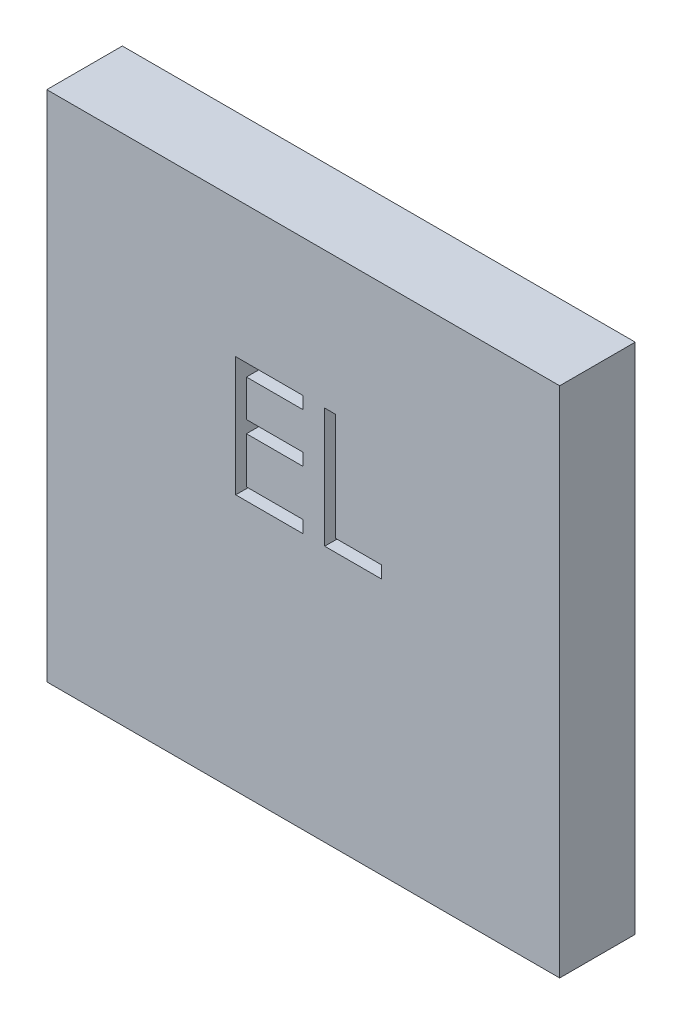
ISO-10303-21;
HEADER;
FILE_DESCRIPTION(('STEP AP214'),'2;1');
FILE_NAME('part.step','',(''),(''),'','','');
FILE_SCHEMA(('AUTOMOTIVE_DESIGN { 1 0 10303 214 1 1 1 1 }'));
ENDSEC;
DATA;
#1=APPLICATION_CONTEXT('core data for automotive mechanical design processes');
#2=APPLICATION_PROTOCOL_DEFINITION('international standard','automotive_design',2000,#1);
#3=PRODUCT_CONTEXT('',#1,'mechanical');
#4=PRODUCT('Part','Part','',(#3));
#5=PRODUCT_RELATED_PRODUCT_CATEGORY('part','',(#4));
#6=PRODUCT_DEFINITION_FORMATION('','',#4);
#7=PRODUCT_DEFINITION_CONTEXT('part definition',#1,'design');
#8=PRODUCT_DEFINITION('design','',#6,#7);
#9=PRODUCT_DEFINITION_SHAPE('','',#8);
#10=(LENGTH_UNIT() NAMED_UNIT(*) SI_UNIT(.MILLI.,.METRE.));
#11=(NAMED_UNIT(*) PLANE_ANGLE_UNIT() SI_UNIT($,.RADIAN.));
#12=(NAMED_UNIT(*) SI_UNIT($,.STERADIAN.) SOLID_ANGLE_UNIT());
#13=UNCERTAINTY_MEASURE_WITH_UNIT(LENGTH_MEASURE(1.E-05),#10,'distance_accuracy_value','');
#14=(GEOMETRIC_REPRESENTATION_CONTEXT(3) GLOBAL_UNCERTAINTY_ASSIGNED_CONTEXT((#13)) GLOBAL_UNIT_ASSIGNED_CONTEXT((#10,
#11,#12)) REPRESENTATION_CONTEXT('',''));
#15=CARTESIAN_POINT('',(0.,0.,0.));
#16=DIRECTION('',(0.,0.,1.));
#17=DIRECTION('',(1.,0.,0.));
#18=AXIS2_PLACEMENT_3D('',#15,#16,#17);
#19=CARTESIAN_POINT('',(0.,0.,2.21));
#20=DIRECTION('',(1.,0.,0.));
#21=DIRECTION('',(0.,0.,-1.));
#22=AXIS2_PLACEMENT_3D('',#19,#20,#21);
#23=PLANE('',#22);
#24=DIRECTION('',(0.,-1.,0.));
#25=VECTOR('',#24,1.);
#26=CARTESIAN_POINT('',(0.,0.,0.));
#27=LINE('',#26,#25);
#28=CARTESIAN_POINT('',(0.,15.,0.));
#29=VERTEX_POINT('',#28);
#30=CARTESIAN_POINT('',(0.,0.,0.));
#31=VERTEX_POINT('',#30);
#32=EDGE_CURVE('E307',#29,#31,#27,.T.);
#33=ORIENTED_EDGE('',*,*,#32,.T.);
#34=DIRECTION('',(0.,0.,-1.));
#35=VECTOR('',#34,1.);
#36=CARTESIAN_POINT('',(0.,0.,2.21));
#37=LINE('',#36,#35);
#38=CARTESIAN_POINT('',(0.,0.,2.21));
#39=VERTEX_POINT('',#38);
#40=EDGE_CURVE('E11',#39,#31,#37,.T.);
#41=ORIENTED_EDGE('',*,*,#40,.F.);
#42=DIRECTION('',(0.,-1.,0.));
#43=VECTOR('',#42,1.);
#44=CARTESIAN_POINT('',(0.,0.,2.21));
#45=LINE('',#44,#43);
#46=CARTESIAN_POINT('',(0.,15.,2.21));
#47=VERTEX_POINT('',#46);
#48=EDGE_CURVE('E330',#47,#39,#45,.T.);
#49=ORIENTED_EDGE('',*,*,#48,.F.);
#50=DIRECTION('',(0.,0.,-1.));
#51=VECTOR('',#50,1.);
#52=CARTESIAN_POINT('',(0.,15.,2.21));
#53=LINE('',#52,#51);
#54=EDGE_CURVE('E340',#47,#29,#53,.T.);
#55=ORIENTED_EDGE('',*,*,#54,.T.);
#56=EDGE_LOOP('',(#33,#41,#49,#55));
#57=FACE_BOUND('',#56,.T.);
#58=ADVANCED_FACE('F33',(#57),#23,.F.);
#59=CARTESIAN_POINT('',(0.,0.,2.21));
#60=DIRECTION('',(0.,1.,0.));
#61=DIRECTION('',(0.,0.,1.));
#62=AXIS2_PLACEMENT_3D('',#59,#60,#61);
#63=PLANE('',#62);
#64=DIRECTION('',(1.,0.,0.));
#65=VECTOR('',#64,1.);
#66=CARTESIAN_POINT('',(0.,0.,0.));
#67=LINE('',#66,#65);
#68=CARTESIAN_POINT('',(15.,0.,0.));
#69=VERTEX_POINT('',#68);
#70=EDGE_CURVE('E343',#31,#69,#67,.T.);
#71=ORIENTED_EDGE('',*,*,#70,.T.);
#72=DIRECTION('',(0.,0.,-1.));
#73=VECTOR('',#72,1.);
#74=CARTESIAN_POINT('',(15.,0.,2.21));
#75=LINE('',#74,#73);
#76=CARTESIAN_POINT('',(15.,0.,2.21));
#77=VERTEX_POINT('',#76);
#78=EDGE_CURVE('E40',#77,#69,#75,.T.);
#79=ORIENTED_EDGE('',*,*,#78,.F.);
#80=DIRECTION('',(1.,0.,0.));
#81=VECTOR('',#80,1.);
#82=CARTESIAN_POINT('',(0.,0.,2.21));
#83=LINE('',#82,#81);
#84=EDGE_CURVE('E333',#39,#77,#83,.T.);
#85=ORIENTED_EDGE('',*,*,#84,.F.);
#86=ORIENTED_EDGE('',*,*,#40,.T.);
#87=EDGE_LOOP('',(#71,#79,#85,#86));
#88=FACE_BOUND('',#87,.T.);
#89=ADVANCED_FACE('F372',(#88),#63,.F.);
#90=CARTESIAN_POINT('',(15.,0.,2.21));
#91=DIRECTION('',(-1.,0.,0.));
#92=DIRECTION('',(0.,0.,1.));
#93=AXIS2_PLACEMENT_3D('',#90,#91,#92);
#94=PLANE('',#93);
#95=DIRECTION('',(0.,1.,0.));
#96=VECTOR('',#95,1.);
#97=CARTESIAN_POINT('',(15.,0.,0.));
#98=LINE('',#97,#96);
#99=CARTESIAN_POINT('',(15.,15.,0.));
#100=VERTEX_POINT('',#99);
#101=EDGE_CURVE('E345',#69,#100,#98,.T.);
#102=ORIENTED_EDGE('',*,*,#101,.T.);
#103=DIRECTION('',(0.,0.,-1.));
#104=VECTOR('',#103,1.);
#105=CARTESIAN_POINT('',(15.,15.,2.21));
#106=LINE('',#105,#104);
#107=CARTESIAN_POINT('',(15.,15.,2.21));
#108=VERTEX_POINT('',#107);
#109=EDGE_CURVE('E350',#108,#100,#106,.T.);
#110=ORIENTED_EDGE('',*,*,#109,.F.);
#111=DIRECTION('',(0.,1.,0.));
#112=VECTOR('',#111,1.);
#113=CARTESIAN_POINT('',(15.,0.,2.21));
#114=LINE('',#113,#112);
#115=EDGE_CURVE('E336',#77,#108,#114,.T.);
#116=ORIENTED_EDGE('',*,*,#115,.F.);
#117=ORIENTED_EDGE('',*,*,#78,.T.);
#118=EDGE_LOOP('',(#102,#110,#116,#117));
#119=FACE_BOUND('',#118,.T.);
#120=ADVANCED_FACE('F357',(#119),#94,.F.);
#121=CARTESIAN_POINT('',(0.,15.,2.21));
#122=DIRECTION('',(0.,-1.,0.));
#123=DIRECTION('',(0.,0.,-1.));
#124=AXIS2_PLACEMENT_3D('',#121,#122,#123);
#125=PLANE('',#124);
#126=DIRECTION('',(-1.,0.,0.));
#127=VECTOR('',#126,1.);
#128=CARTESIAN_POINT('',(0.,15.,0.));
#129=LINE('',#128,#127);
#130=EDGE_CURVE('E334',#100,#29,#129,.T.);
#131=ORIENTED_EDGE('',*,*,#130,.T.);
#132=ORIENTED_EDGE('',*,*,#54,.F.);
#133=DIRECTION('',(-1.,0.,0.));
#134=VECTOR('',#133,1.);
#135=CARTESIAN_POINT('',(0.,15.,2.21));
#136=LINE('',#135,#134);
#137=EDGE_CURVE('E338',#108,#47,#136,.T.);
#138=ORIENTED_EDGE('',*,*,#137,.F.);
#139=ORIENTED_EDGE('',*,*,#109,.T.);
#140=EDGE_LOOP('',(#131,#132,#138,#139));
#141=FACE_BOUND('',#140,.T.);
#142=ADVANCED_FACE('F366',(#141),#125,.F.);
#143=CARTESIAN_POINT('',(0.,0.,2.21));
#144=DIRECTION('',(0.,0.,-1.));
#145=DIRECTION('',(-1.,0.,0.));
#146=AXIS2_PLACEMENT_3D('',#143,#144,#145);
#147=PLANE('',#146);
#148=DIRECTION('',(-1.,0.,0.));
#149=VECTOR('',#148,1.);
#150=CARTESIAN_POINT('',(9.78846153846154,7.5,2.21));
#151=LINE('',#150,#149);
#152=CARTESIAN_POINT('',(9.78846153846154,7.5,2.21));
#153=VERTEX_POINT('',#152);
#154=CARTESIAN_POINT('',(8.12820512820513,7.5,2.21));
#155=VERTEX_POINT('',#154);
#156=EDGE_CURVE('E189',#153,#155,#151,.T.);
#157=ORIENTED_EDGE('',*,*,#156,.T.);
#158=DIRECTION('',(0.,1.,0.));
#159=VECTOR('',#158,1.);
#160=CARTESIAN_POINT('',(8.12820512820513,7.5,2.21));
#161=LINE('',#160,#159);
#162=CARTESIAN_POINT('',(8.12820512820513,11.,2.21));
#163=VERTEX_POINT('',#162);
#164=EDGE_CURVE('E183',#155,#163,#161,.T.);
#165=ORIENTED_EDGE('',*,*,#164,.T.);
#166=DIRECTION('',(1.,0.,0.));
#167=VECTOR('',#166,1.);
#168=CARTESIAN_POINT('',(8.12820512820513,11.,2.21));
#169=LINE('',#168,#167);
#170=CARTESIAN_POINT('',(8.44230769230769,11.,2.21));
#171=VERTEX_POINT('',#170);
#172=EDGE_CURVE('E192',#163,#171,#169,.T.);
#173=ORIENTED_EDGE('',*,*,#172,.T.);
#174=DIRECTION('',(0.,-1.,0.));
#175=VECTOR('',#174,1.);
#176=CARTESIAN_POINT('',(8.44230769230769,11.,2.21));
#177=LINE('',#176,#175);
#178=CARTESIAN_POINT('',(8.44230769230769,7.85897435897436,2.21));
#179=VERTEX_POINT('',#178);
#180=EDGE_CURVE('E47',#171,#179,#177,.T.);
#181=ORIENTED_EDGE('',*,*,#180,.T.);
#182=DIRECTION('',(1.,0.,0.));
#183=VECTOR('',#182,1.);
#184=CARTESIAN_POINT('',(8.44230769230769,7.85897435897436,2.21));
#185=LINE('',#184,#183);
#186=CARTESIAN_POINT('',(9.78846153846154,7.85897435897436,2.21));
#187=VERTEX_POINT('',#186);
#188=EDGE_CURVE('E207',#179,#187,#185,.T.);
#189=ORIENTED_EDGE('',*,*,#188,.T.);
#190=DIRECTION('',(0.,-1.,0.));
#191=VECTOR('',#190,1.);
#192=CARTESIAN_POINT('',(9.78846153846154,7.85897435897436,2.21));
#193=LINE('',#192,#191);
#194=EDGE_CURVE('E210',#187,#153,#193,.T.);
#195=ORIENTED_EDGE('',*,*,#194,.T.);
#196=EDGE_LOOP('',(#157,#165,#173,#181,#189,#195));
#197=FACE_BOUND('',#196,.T.);
#198=DIRECTION('',(-1.,0.,0.));
#199=VECTOR('',#198,1.);
#200=CARTESIAN_POINT('',(7.5,7.5,2.21));
#201=LINE('',#200,#199);
#202=CARTESIAN_POINT('',(7.5,7.5,2.21));
#203=VERTEX_POINT('',#202);
#204=CARTESIAN_POINT('',(5.52564102564103,7.5,2.21));
#205=VERTEX_POINT('',#204);
#206=EDGE_CURVE('E268',#203,#205,#201,.T.);
#207=ORIENTED_EDGE('',*,*,#206,.T.);
#208=DIRECTION('',(0.,1.,0.));
#209=VECTOR('',#208,1.);
#210=CARTESIAN_POINT('',(5.52564102564103,7.5,2.21));
#211=LINE('',#210,#209);
#212=CARTESIAN_POINT('',(5.52564102564103,11.,2.21));
#213=VERTEX_POINT('',#212);
#214=EDGE_CURVE('E234',#205,#213,#211,.T.);
#215=ORIENTED_EDGE('',*,*,#214,.T.);
#216=DIRECTION('',(1.,0.,0.));
#217=VECTOR('',#216,1.);
#218=CARTESIAN_POINT('',(5.52564102564103,11.,2.21));
#219=LINE('',#218,#217);
#220=CARTESIAN_POINT('',(7.5,11.,2.21));
#221=VERTEX_POINT('',#220);
#222=EDGE_CURVE('E237',#213,#221,#219,.T.);
#223=ORIENTED_EDGE('',*,*,#222,.T.);
#224=DIRECTION('',(0.,-1.,0.));
#225=VECTOR('',#224,1.);
#226=CARTESIAN_POINT('',(7.5,11.,2.21));
#227=LINE('',#226,#225);
#228=CARTESIAN_POINT('',(7.5,10.6410256410256,2.21));
#229=VERTEX_POINT('',#228);
#230=EDGE_CURVE('E241',#221,#229,#227,.T.);
#231=ORIENTED_EDGE('',*,*,#230,.T.);
#232=DIRECTION('',(-1.,0.,0.));
#233=VECTOR('',#232,1.);
#234=CARTESIAN_POINT('',(7.5,10.6410256410256,2.21));
#235=LINE('',#234,#233);
#236=CARTESIAN_POINT('',(5.83974358974359,10.6410256410256,2.21));
#237=VERTEX_POINT('',#236);
#238=EDGE_CURVE('E244',#229,#237,#235,.T.);
#239=ORIENTED_EDGE('',*,*,#238,.T.);
#240=DIRECTION('',(0.,-1.,0.));
#241=VECTOR('',#240,1.);
#242=CARTESIAN_POINT('',(5.83974358974359,10.6410256410256,2.21));
#243=LINE('',#242,#241);
#244=CARTESIAN_POINT('',(5.83974358974359,9.56410256410256,2.21));
#245=VERTEX_POINT('',#244);
#246=EDGE_CURVE('E247',#237,#245,#243,.T.);
#247=ORIENTED_EDGE('',*,*,#246,.T.);
#248=DIRECTION('',(1.,0.,0.));
#249=VECTOR('',#248,1.);
#250=CARTESIAN_POINT('',(5.83974358974359,9.56410256410256,2.21));
#251=LINE('',#250,#249);
#252=CARTESIAN_POINT('',(7.5,9.56410256410256,2.21));
#253=VERTEX_POINT('',#252);
#254=EDGE_CURVE('E250',#245,#253,#251,.T.);
#255=ORIENTED_EDGE('',*,*,#254,.T.);
#256=DIRECTION('',(0.,-1.,0.));
#257=VECTOR('',#256,1.);
#258=CARTESIAN_POINT('',(7.5,9.56410256410256,2.21));
#259=LINE('',#258,#257);
#260=CARTESIAN_POINT('',(7.5,9.2051282051282,2.21));
#261=VERTEX_POINT('',#260);
#262=EDGE_CURVE('E253',#253,#261,#259,.T.);
#263=ORIENTED_EDGE('',*,*,#262,.T.);
#264=DIRECTION('',(-1.,0.,0.));
#265=VECTOR('',#264,1.);
#266=CARTESIAN_POINT('',(7.5,9.2051282051282,2.21));
#267=LINE('',#266,#265);
#268=CARTESIAN_POINT('',(5.83974358974359,9.2051282051282,2.21));
#269=VERTEX_POINT('',#268);
#270=EDGE_CURVE('E256',#261,#269,#267,.T.);
#271=ORIENTED_EDGE('',*,*,#270,.T.);
#272=DIRECTION('',(0.,-1.,0.));
#273=VECTOR('',#272,1.);
#274=CARTESIAN_POINT('',(5.83974358974359,9.2051282051282,2.21));
#275=LINE('',#274,#273);
#276=CARTESIAN_POINT('',(5.83974358974359,7.85897435897436,2.21));
#277=VERTEX_POINT('',#276);
#278=EDGE_CURVE('E259',#269,#277,#275,.T.);
#279=ORIENTED_EDGE('',*,*,#278,.T.);
#280=DIRECTION('',(1.,0.,0.));
#281=VECTOR('',#280,1.);
#282=CARTESIAN_POINT('',(5.83974358974359,7.85897435897436,2.21));
#283=LINE('',#282,#281);
#284=CARTESIAN_POINT('',(7.5,7.85897435897436,2.21));
#285=VERTEX_POINT('',#284);
#286=EDGE_CURVE('E262',#277,#285,#283,.T.);
#287=ORIENTED_EDGE('',*,*,#286,.T.);
#288=DIRECTION('',(0.,-1.,0.));
#289=VECTOR('',#288,1.);
#290=CARTESIAN_POINT('',(7.5,7.85897435897436,2.21));
#291=LINE('',#290,#289);
#292=EDGE_CURVE('E265',#285,#203,#291,.T.);
#293=ORIENTED_EDGE('',*,*,#292,.T.);
#294=EDGE_LOOP('',(#207,#215,#223,#231,#239,#247,#255,#263,#271,#279,#287,#293));
#295=FACE_BOUND('',#294,.T.);
#296=ORIENTED_EDGE('',*,*,#48,.T.);
#297=ORIENTED_EDGE('',*,*,#84,.T.);
#298=ORIENTED_EDGE('',*,*,#115,.T.);
#299=ORIENTED_EDGE('',*,*,#137,.T.);
#300=EDGE_LOOP('',(#296,#297,#298,#299));
#301=FACE_BOUND('',#300,.T.);
#302=ADVANCED_FACE('F196',(#197,#295,#301),#147,.F.);
#303=CARTESIAN_POINT('',(0.,0.,0.));
#304=DIRECTION('',(0.,0.,-1.));
#305=DIRECTION('',(-1.,0.,0.));
#306=AXIS2_PLACEMENT_3D('',#303,#304,#305);
#307=PLANE('',#306);
#308=DIRECTION('',(0.,1.,0.));
#309=VECTOR('',#308,1.);
#310=CARTESIAN_POINT('',(8.12820512820513,7.5,0.));
#311=LINE('',#310,#309);
#312=CARTESIAN_POINT('',(8.12820512820513,7.5,0.));
#313=VERTEX_POINT('',#312);
#314=CARTESIAN_POINT('',(8.12820512820513,11.,0.));
#315=VERTEX_POINT('',#314);
#316=EDGE_CURVE('E55',#313,#315,#311,.T.);
#317=ORIENTED_EDGE('',*,*,#316,.F.);
#318=DIRECTION('',(-1.,0.,0.));
#319=VECTOR('',#318,1.);
#320=CARTESIAN_POINT('',(9.78846153846154,7.5,0.));
#321=LINE('',#320,#319);
#322=CARTESIAN_POINT('',(9.78846153846154,7.5,0.));
#323=VERTEX_POINT('',#322);
#324=EDGE_CURVE('E200',#323,#313,#321,.T.);
#325=ORIENTED_EDGE('',*,*,#324,.F.);
#326=DIRECTION('',(0.,-1.,0.));
#327=VECTOR('',#326,1.);
#328=CARTESIAN_POINT('',(9.78846153846154,7.85897435897436,0.));
#329=LINE('',#328,#327);
#330=CARTESIAN_POINT('',(9.78846153846154,7.85897435897436,0.));
#331=VERTEX_POINT('',#330);
#332=EDGE_CURVE('E203',#331,#323,#329,.T.);
#333=ORIENTED_EDGE('',*,*,#332,.F.);
#334=DIRECTION('',(1.,0.,0.));
#335=VECTOR('',#334,1.);
#336=CARTESIAN_POINT('',(8.44230769230769,7.85897435897436,0.));
#337=LINE('',#336,#335);
#338=CARTESIAN_POINT('',(8.44230769230769,7.85897435897436,0.));
#339=VERTEX_POINT('',#338);
#340=EDGE_CURVE('E219',#339,#331,#337,.T.);
#341=ORIENTED_EDGE('',*,*,#340,.F.);
#342=DIRECTION('',(0.,-1.,0.));
#343=VECTOR('',#342,1.);
#344=CARTESIAN_POINT('',(8.44230769230769,11.,0.));
#345=LINE('',#344,#343);
#346=CARTESIAN_POINT('',(8.44230769230769,11.,0.));
#347=VERTEX_POINT('',#346);
#348=EDGE_CURVE('E216',#347,#339,#345,.T.);
#349=ORIENTED_EDGE('',*,*,#348,.F.);
#350=DIRECTION('',(1.,0.,0.));
#351=VECTOR('',#350,1.);
#352=CARTESIAN_POINT('',(8.12820512820513,11.,0.));
#353=LINE('',#352,#351);
#354=EDGE_CURVE('E214',#315,#347,#353,.T.);
#355=ORIENTED_EDGE('',*,*,#354,.F.);
#356=EDGE_LOOP('',(#317,#325,#333,#341,#349,#355));
#357=FACE_BOUND('',#356,.T.);
#358=DIRECTION('',(0.,1.,0.));
#359=VECTOR('',#358,1.);
#360=CARTESIAN_POINT('',(5.52564102564103,7.5,0.));
#361=LINE('',#360,#359);
#362=CARTESIAN_POINT('',(5.52564102564103,7.5,0.));
#363=VERTEX_POINT('',#362);
#364=CARTESIAN_POINT('',(5.52564102564103,11.,0.));
#365=VERTEX_POINT('',#364);
#366=EDGE_CURVE('E226',#363,#365,#361,.T.);
#367=ORIENTED_EDGE('',*,*,#366,.F.);
#368=DIRECTION('',(-1.,0.,0.));
#369=VECTOR('',#368,1.);
#370=CARTESIAN_POINT('',(7.5,7.5,0.));
#371=LINE('',#370,#369);
#372=CARTESIAN_POINT('',(7.5,7.5,0.));
#373=VERTEX_POINT('',#372);
#374=EDGE_CURVE('E238',#373,#363,#371,.T.);
#375=ORIENTED_EDGE('',*,*,#374,.F.);
#376=DIRECTION('',(0.,-1.,0.));
#377=VECTOR('',#376,1.);
#378=CARTESIAN_POINT('',(7.5,7.85897435897436,0.));
#379=LINE('',#378,#377);
#380=CARTESIAN_POINT('',(7.5,7.85897435897436,0.));
#381=VERTEX_POINT('',#380);
#382=EDGE_CURVE('E300',#381,#373,#379,.T.);
#383=ORIENTED_EDGE('',*,*,#382,.F.);
#384=DIRECTION('',(1.,0.,0.));
#385=VECTOR('',#384,1.);
#386=CARTESIAN_POINT('',(5.83974358974359,7.85897435897436,0.));
#387=LINE('',#386,#385);
#388=CARTESIAN_POINT('',(5.83974358974359,7.85897435897436,0.));
#389=VERTEX_POINT('',#388);
#390=EDGE_CURVE('E297',#389,#381,#387,.T.);
#391=ORIENTED_EDGE('',*,*,#390,.F.);
#392=DIRECTION('',(0.,-1.,0.));
#393=VECTOR('',#392,1.);
#394=CARTESIAN_POINT('',(5.83974358974359,9.2051282051282,0.));
#395=LINE('',#394,#393);
#396=CARTESIAN_POINT('',(5.83974358974359,9.2051282051282,0.));
#397=VERTEX_POINT('',#396);
#398=EDGE_CURVE('E294',#397,#389,#395,.T.);
#399=ORIENTED_EDGE('',*,*,#398,.F.);
#400=DIRECTION('',(-1.,0.,0.));
#401=VECTOR('',#400,1.);
#402=CARTESIAN_POINT('',(7.5,9.2051282051282,0.));
#403=LINE('',#402,#401);
#404=CARTESIAN_POINT('',(7.5,9.2051282051282,0.));
#405=VERTEX_POINT('',#404);
#406=EDGE_CURVE('E291',#405,#397,#403,.T.);
#407=ORIENTED_EDGE('',*,*,#406,.F.);
#408=DIRECTION('',(0.,-1.,0.));
#409=VECTOR('',#408,1.);
#410=CARTESIAN_POINT('',(7.5,9.56410256410256,0.));
#411=LINE('',#410,#409);
#412=CARTESIAN_POINT('',(7.5,9.56410256410256,0.));
#413=VERTEX_POINT('',#412);
#414=EDGE_CURVE('E288',#413,#405,#411,.T.);
#415=ORIENTED_EDGE('',*,*,#414,.F.);
#416=DIRECTION('',(1.,0.,0.));
#417=VECTOR('',#416,1.);
#418=CARTESIAN_POINT('',(5.83974358974359,9.56410256410256,0.));
#419=LINE('',#418,#417);
#420=CARTESIAN_POINT('',(5.83974358974359,9.56410256410256,0.));
#421=VERTEX_POINT('',#420);
#422=EDGE_CURVE('E285',#421,#413,#419,.T.);
#423=ORIENTED_EDGE('',*,*,#422,.F.);
#424=DIRECTION('',(0.,-1.,0.));
#425=VECTOR('',#424,1.);
#426=CARTESIAN_POINT('',(5.83974358974359,10.6410256410256,0.));
#427=LINE('',#426,#425);
#428=CARTESIAN_POINT('',(5.83974358974359,10.6410256410256,0.));
#429=VERTEX_POINT('',#428);
#430=EDGE_CURVE('E282',#429,#421,#427,.T.);
#431=ORIENTED_EDGE('',*,*,#430,.F.);
#432=DIRECTION('',(-1.,0.,0.));
#433=VECTOR('',#432,1.);
#434=CARTESIAN_POINT('',(7.5,10.6410256410256,0.));
#435=LINE('',#434,#433);
#436=CARTESIAN_POINT('',(7.5,10.6410256410256,0.));
#437=VERTEX_POINT('',#436);
#438=EDGE_CURVE('E279',#437,#429,#435,.T.);
#439=ORIENTED_EDGE('',*,*,#438,.F.);
#440=DIRECTION('',(0.,-1.,0.));
#441=VECTOR('',#440,1.);
#442=CARTESIAN_POINT('',(7.5,11.,0.));
#443=LINE('',#442,#441);
#444=CARTESIAN_POINT('',(7.5,11.,0.));
#445=VERTEX_POINT('',#444);
#446=EDGE_CURVE('E276',#445,#437,#443,.T.);
#447=ORIENTED_EDGE('',*,*,#446,.F.);
#448=DIRECTION('',(1.,0.,0.));
#449=VECTOR('',#448,1.);
#450=CARTESIAN_POINT('',(5.52564102564103,11.,0.));
#451=LINE('',#450,#449);
#452=EDGE_CURVE('E273',#365,#445,#451,.T.);
#453=ORIENTED_EDGE('',*,*,#452,.F.);
#454=EDGE_LOOP('',(#367,#375,#383,#391,#399,#407,#415,#423,#431,#439,#447,#453));
#455=FACE_BOUND('',#454,.T.);
#456=ORIENTED_EDGE('',*,*,#32,.F.);
#457=ORIENTED_EDGE('',*,*,#130,.F.);
#458=ORIENTED_EDGE('',*,*,#101,.F.);
#459=ORIENTED_EDGE('',*,*,#70,.F.);
#460=EDGE_LOOP('',(#456,#457,#458,#459));
#461=FACE_BOUND('',#460,.T.);
#462=ADVANCED_FACE('F363',(#357,#455,#461),#307,.T.);
#463=CARTESIAN_POINT('',(5.52564102564103,7.5,2.21));
#464=DIRECTION('',(-1.,0.,0.));
#465=DIRECTION('',(0.,0.,1.));
#466=AXIS2_PLACEMENT_3D('',#463,#464,#465);
#467=PLANE('',#466);
#468=ORIENTED_EDGE('',*,*,#366,.T.);
#469=DIRECTION('',(0.,0.,-1.));
#470=VECTOR('',#469,1.);
#471=CARTESIAN_POINT('',(5.52564102564103,11.,2.21));
#472=LINE('',#471,#470);
#473=EDGE_CURVE('E271',#213,#365,#472,.T.);
#474=ORIENTED_EDGE('',*,*,#473,.F.);
#475=ORIENTED_EDGE('',*,*,#214,.F.);
#476=DIRECTION('',(0.,0.,-1.));
#477=VECTOR('',#476,1.);
#478=CARTESIAN_POINT('',(5.52564102564103,7.5,2.21));
#479=LINE('',#478,#477);
#480=EDGE_CURVE('E305',#205,#363,#479,.T.);
#481=ORIENTED_EDGE('',*,*,#480,.T.);
#482=EDGE_LOOP('',(#468,#474,#475,#481));
#483=FACE_BOUND('',#482,.T.);
#484=ADVANCED_FACE('F384',(#483),#467,.F.);
#485=CARTESIAN_POINT('',(7.5,7.5,2.21));
#486=DIRECTION('',(0.,-1.,0.));
#487=DIRECTION('',(0.,0.,-1.));
#488=AXIS2_PLACEMENT_3D('',#485,#486,#487);
#489=PLANE('',#488);
#490=ORIENTED_EDGE('',*,*,#374,.T.);
#491=ORIENTED_EDGE('',*,*,#480,.F.);
#492=ORIENTED_EDGE('',*,*,#206,.F.);
#493=DIRECTION('',(0.,0.,-1.));
#494=VECTOR('',#493,1.);
#495=CARTESIAN_POINT('',(7.5,7.5,2.21));
#496=LINE('',#495,#494);
#497=EDGE_CURVE('E308',#203,#373,#496,.T.);
#498=ORIENTED_EDGE('',*,*,#497,.T.);
#499=EDGE_LOOP('',(#490,#491,#492,#498));
#500=FACE_BOUND('',#499,.T.);
#501=ADVANCED_FACE('F390',(#500),#489,.F.);
#502=CARTESIAN_POINT('',(7.5,7.85897435897436,2.21));
#503=DIRECTION('',(1.,0.,0.));
#504=DIRECTION('',(0.,0.,-1.));
#505=AXIS2_PLACEMENT_3D('',#502,#503,#504);
#506=PLANE('',#505);
#507=ORIENTED_EDGE('',*,*,#382,.T.);
#508=ORIENTED_EDGE('',*,*,#497,.F.);
#509=ORIENTED_EDGE('',*,*,#292,.F.);
#510=DIRECTION('',(0.,0.,-1.));
#511=VECTOR('',#510,1.);
#512=CARTESIAN_POINT('',(7.5,7.85897435897436,2.21));
#513=LINE('',#512,#511);
#514=EDGE_CURVE('E310',#285,#381,#513,.T.);
#515=ORIENTED_EDGE('',*,*,#514,.T.);
#516=EDGE_LOOP('',(#507,#508,#509,#515));
#517=FACE_BOUND('',#516,.T.);
#518=ADVANCED_FACE('F427',(#517),#506,.F.);
#519=CARTESIAN_POINT('',(5.83974358974359,7.85897435897436,2.21));
#520=DIRECTION('',(0.,1.,0.));
#521=DIRECTION('',(0.,0.,1.));
#522=AXIS2_PLACEMENT_3D('',#519,#520,#521);
#523=PLANE('',#522);
#524=ORIENTED_EDGE('',*,*,#390,.T.);
#525=ORIENTED_EDGE('',*,*,#514,.F.);
#526=ORIENTED_EDGE('',*,*,#286,.F.);
#527=DIRECTION('',(0.,0.,-1.));
#528=VECTOR('',#527,1.);
#529=CARTESIAN_POINT('',(5.83974358974359,7.85897435897436,2.21));
#530=LINE('',#529,#528);
#531=EDGE_CURVE('E312',#277,#389,#530,.T.);
#532=ORIENTED_EDGE('',*,*,#531,.T.);
#533=EDGE_LOOP('',(#524,#525,#526,#532));
#534=FACE_BOUND('',#533,.T.);
#535=ADVANCED_FACE('F423',(#534),#523,.F.);
#536=CARTESIAN_POINT('',(5.83974358974359,9.2051282051282,2.21));
#537=DIRECTION('',(1.,0.,0.));
#538=DIRECTION('',(0.,0.,-1.));
#539=AXIS2_PLACEMENT_3D('',#536,#537,#538);
#540=PLANE('',#539);
#541=ORIENTED_EDGE('',*,*,#398,.T.);
#542=ORIENTED_EDGE('',*,*,#531,.F.);
#543=ORIENTED_EDGE('',*,*,#278,.F.);
#544=DIRECTION('',(0.,0.,-1.));
#545=VECTOR('',#544,1.);
#546=CARTESIAN_POINT('',(5.83974358974359,9.2051282051282,2.21));
#547=LINE('',#546,#545);
#548=EDGE_CURVE('E314',#269,#397,#547,.T.);
#549=ORIENTED_EDGE('',*,*,#548,.T.);
#550=EDGE_LOOP('',(#541,#542,#543,#549));
#551=FACE_BOUND('',#550,.T.);
#552=ADVANCED_FACE('F419',(#551),#540,.F.);
#553=CARTESIAN_POINT('',(7.5,9.2051282051282,2.21));
#554=DIRECTION('',(0.,-1.,0.));
#555=DIRECTION('',(0.,0.,-1.));
#556=AXIS2_PLACEMENT_3D('',#553,#554,#555);
#557=PLANE('',#556);
#558=ORIENTED_EDGE('',*,*,#406,.T.);
#559=ORIENTED_EDGE('',*,*,#548,.F.);
#560=ORIENTED_EDGE('',*,*,#270,.F.);
#561=DIRECTION('',(0.,0.,-1.));
#562=VECTOR('',#561,1.);
#563=CARTESIAN_POINT('',(7.5,9.2051282051282,2.21));
#564=LINE('',#563,#562);
#565=EDGE_CURVE('E316',#261,#405,#564,.T.);
#566=ORIENTED_EDGE('',*,*,#565,.T.);
#567=EDGE_LOOP('',(#558,#559,#560,#566));
#568=FACE_BOUND('',#567,.T.);
#569=ADVANCED_FACE('F415',(#568),#557,.F.);
#570=CARTESIAN_POINT('',(7.5,9.56410256410256,2.21));
#571=DIRECTION('',(1.,0.,0.));
#572=DIRECTION('',(0.,0.,-1.));
#573=AXIS2_PLACEMENT_3D('',#570,#571,#572);
#574=PLANE('',#573);
#575=ORIENTED_EDGE('',*,*,#414,.T.);
#576=ORIENTED_EDGE('',*,*,#565,.F.);
#577=ORIENTED_EDGE('',*,*,#262,.F.);
#578=DIRECTION('',(0.,0.,-1.));
#579=VECTOR('',#578,1.);
#580=CARTESIAN_POINT('',(7.5,9.56410256410256,2.21));
#581=LINE('',#580,#579);
#582=EDGE_CURVE('E318',#253,#413,#581,.T.);
#583=ORIENTED_EDGE('',*,*,#582,.T.);
#584=EDGE_LOOP('',(#575,#576,#577,#583));
#585=FACE_BOUND('',#584,.T.);
#586=ADVANCED_FACE('F411',(#585),#574,.F.);
#587=CARTESIAN_POINT('',(5.83974358974359,9.56410256410256,2.21));
#588=DIRECTION('',(0.,1.,0.));
#589=DIRECTION('',(0.,0.,1.));
#590=AXIS2_PLACEMENT_3D('',#587,#588,#589);
#591=PLANE('',#590);
#592=ORIENTED_EDGE('',*,*,#422,.T.);
#593=ORIENTED_EDGE('',*,*,#582,.F.);
#594=ORIENTED_EDGE('',*,*,#254,.F.);
#595=DIRECTION('',(0.,0.,-1.));
#596=VECTOR('',#595,1.);
#597=CARTESIAN_POINT('',(5.83974358974359,9.56410256410256,2.21));
#598=LINE('',#597,#596);
#599=EDGE_CURVE('E320',#245,#421,#598,.T.);
#600=ORIENTED_EDGE('',*,*,#599,.T.);
#601=EDGE_LOOP('',(#592,#593,#594,#600));
#602=FACE_BOUND('',#601,.T.);
#603=ADVANCED_FACE('F407',(#602),#591,.F.);
#604=CARTESIAN_POINT('',(5.83974358974359,10.6410256410256,2.21));
#605=DIRECTION('',(1.,0.,0.));
#606=DIRECTION('',(0.,0.,-1.));
#607=AXIS2_PLACEMENT_3D('',#604,#605,#606);
#608=PLANE('',#607);
#609=ORIENTED_EDGE('',*,*,#430,.T.);
#610=ORIENTED_EDGE('',*,*,#599,.F.);
#611=ORIENTED_EDGE('',*,*,#246,.F.);
#612=DIRECTION('',(0.,0.,-1.));
#613=VECTOR('',#612,1.);
#614=CARTESIAN_POINT('',(5.83974358974359,10.6410256410256,2.21));
#615=LINE('',#614,#613);
#616=EDGE_CURVE('E322',#237,#429,#615,.T.);
#617=ORIENTED_EDGE('',*,*,#616,.T.);
#618=EDGE_LOOP('',(#609,#610,#611,#617));
#619=FACE_BOUND('',#618,.T.);
#620=ADVANCED_FACE('F403',(#619),#608,.F.);
#621=CARTESIAN_POINT('',(7.5,10.6410256410256,2.21));
#622=DIRECTION('',(0.,-1.,0.));
#623=DIRECTION('',(0.,0.,-1.));
#624=AXIS2_PLACEMENT_3D('',#621,#622,#623);
#625=PLANE('',#624);
#626=ORIENTED_EDGE('',*,*,#438,.T.);
#627=ORIENTED_EDGE('',*,*,#616,.F.);
#628=ORIENTED_EDGE('',*,*,#238,.F.);
#629=DIRECTION('',(0.,0.,-1.));
#630=VECTOR('',#629,1.);
#631=CARTESIAN_POINT('',(7.5,10.6410256410256,2.21));
#632=LINE('',#631,#630);
#633=EDGE_CURVE('E324',#229,#437,#632,.T.);
#634=ORIENTED_EDGE('',*,*,#633,.T.);
#635=EDGE_LOOP('',(#626,#627,#628,#634));
#636=FACE_BOUND('',#635,.T.);
#637=ADVANCED_FACE('F399',(#636),#625,.F.);
#638=CARTESIAN_POINT('',(7.5,11.,2.21));
#639=DIRECTION('',(1.,0.,0.));
#640=DIRECTION('',(0.,0.,-1.));
#641=AXIS2_PLACEMENT_3D('',#638,#639,#640);
#642=PLANE('',#641);
#643=ORIENTED_EDGE('',*,*,#446,.T.);
#644=ORIENTED_EDGE('',*,*,#633,.F.);
#645=ORIENTED_EDGE('',*,*,#230,.F.);
#646=DIRECTION('',(0.,0.,-1.));
#647=VECTOR('',#646,1.);
#648=CARTESIAN_POINT('',(7.5,11.,2.21));
#649=LINE('',#648,#647);
#650=EDGE_CURVE('E326',#221,#445,#649,.T.);
#651=ORIENTED_EDGE('',*,*,#650,.T.);
#652=EDGE_LOOP('',(#643,#644,#645,#651));
#653=FACE_BOUND('',#652,.T.);
#654=ADVANCED_FACE('F395',(#653),#642,.F.);
#655=CARTESIAN_POINT('',(5.52564102564103,11.,2.21));
#656=DIRECTION('',(0.,1.,0.));
#657=DIRECTION('',(0.,0.,1.));
#658=AXIS2_PLACEMENT_3D('',#655,#656,#657);
#659=PLANE('',#658);
#660=ORIENTED_EDGE('',*,*,#452,.T.);
#661=ORIENTED_EDGE('',*,*,#650,.F.);
#662=ORIENTED_EDGE('',*,*,#222,.F.);
#663=ORIENTED_EDGE('',*,*,#473,.T.);
#664=EDGE_LOOP('',(#660,#661,#662,#663));
#665=FACE_BOUND('',#664,.T.);
#666=ADVANCED_FACE('F392',(#665),#659,.F.);
#667=CARTESIAN_POINT('',(8.12820512820513,7.5,2.21));
#668=DIRECTION('',(-1.,0.,0.));
#669=DIRECTION('',(0.,0.,1.));
#670=AXIS2_PLACEMENT_3D('',#667,#668,#669);
#671=PLANE('',#670);
#672=ORIENTED_EDGE('',*,*,#316,.T.);
#673=DIRECTION('',(0.,0.,-1.));
#674=VECTOR('',#673,1.);
#675=CARTESIAN_POINT('',(8.12820512820513,11.,2.21));
#676=LINE('',#675,#674);
#677=EDGE_CURVE('E179',#163,#315,#676,.T.);
#678=ORIENTED_EDGE('',*,*,#677,.F.);
#679=ORIENTED_EDGE('',*,*,#164,.F.);
#680=DIRECTION('',(0.,0.,-1.));
#681=VECTOR('',#680,1.);
#682=CARTESIAN_POINT('',(8.12820512820513,7.5,2.21));
#683=LINE('',#682,#681);
#684=EDGE_CURVE('E224',#155,#313,#683,.T.);
#685=ORIENTED_EDGE('',*,*,#684,.T.);
#686=EDGE_LOOP('',(#672,#678,#679,#685));
#687=FACE_BOUND('',#686,.T.);
#688=ADVANCED_FACE('F181',(#687),#671,.F.);
#689=CARTESIAN_POINT('',(9.78846153846154,7.5,2.21));
#690=DIRECTION('',(0.,-1.,0.));
#691=DIRECTION('',(0.,0.,-1.));
#692=AXIS2_PLACEMENT_3D('',#689,#690,#691);
#693=PLANE('',#692);
#694=ORIENTED_EDGE('',*,*,#324,.T.);
#695=ORIENTED_EDGE('',*,*,#684,.F.);
#696=ORIENTED_EDGE('',*,*,#156,.F.);
#697=DIRECTION('',(0.,0.,-1.));
#698=VECTOR('',#697,1.);
#699=CARTESIAN_POINT('',(9.78846153846154,7.5,2.21));
#700=LINE('',#699,#698);
#701=EDGE_CURVE('E227',#153,#323,#700,.T.);
#702=ORIENTED_EDGE('',*,*,#701,.T.);
#703=EDGE_LOOP('',(#694,#695,#696,#702));
#704=FACE_BOUND('',#703,.T.);
#705=ADVANCED_FACE('F437',(#704),#693,.F.);
#706=CARTESIAN_POINT('',(9.78846153846154,7.85897435897436,2.21));
#707=DIRECTION('',(1.,0.,0.));
#708=DIRECTION('',(0.,0.,-1.));
#709=AXIS2_PLACEMENT_3D('',#706,#707,#708);
#710=PLANE('',#709);
#711=ORIENTED_EDGE('',*,*,#332,.T.);
#712=ORIENTED_EDGE('',*,*,#701,.F.);
#713=ORIENTED_EDGE('',*,*,#194,.F.);
#714=DIRECTION('',(0.,0.,-1.));
#715=VECTOR('',#714,1.);
#716=CARTESIAN_POINT('',(9.78846153846154,7.85897435897436,2.21));
#717=LINE('',#716,#715);
#718=EDGE_CURVE('E229',#187,#331,#717,.T.);
#719=ORIENTED_EDGE('',*,*,#718,.T.);
#720=EDGE_LOOP('',(#711,#712,#713,#719));
#721=FACE_BOUND('',#720,.T.);
#722=ADVANCED_FACE('F446',(#721),#710,.F.);
#723=CARTESIAN_POINT('',(8.44230769230769,7.85897435897436,2.21));
#724=DIRECTION('',(0.,1.,0.));
#725=DIRECTION('',(0.,0.,1.));
#726=AXIS2_PLACEMENT_3D('',#723,#724,#725);
#727=PLANE('',#726);
#728=ORIENTED_EDGE('',*,*,#340,.T.);
#729=ORIENTED_EDGE('',*,*,#718,.F.);
#730=ORIENTED_EDGE('',*,*,#188,.F.);
#731=DIRECTION('',(0.,0.,-1.));
#732=VECTOR('',#731,1.);
#733=CARTESIAN_POINT('',(8.44230769230769,7.85897435897436,2.21));
#734=LINE('',#733,#732);
#735=EDGE_CURVE('E231',#179,#339,#734,.T.);
#736=ORIENTED_EDGE('',*,*,#735,.T.);
#737=EDGE_LOOP('',(#728,#729,#730,#736));
#738=FACE_BOUND('',#737,.T.);
#739=ADVANCED_FACE('F443',(#738),#727,.F.);
#740=CARTESIAN_POINT('',(8.44230769230769,11.,2.21));
#741=DIRECTION('',(1.,0.,0.));
#742=DIRECTION('',(0.,0.,-1.));
#743=AXIS2_PLACEMENT_3D('',#740,#741,#742);
#744=PLANE('',#743);
#745=ORIENTED_EDGE('',*,*,#348,.T.);
#746=ORIENTED_EDGE('',*,*,#735,.F.);
#747=ORIENTED_EDGE('',*,*,#180,.F.);
#748=DIRECTION('',(0.,0.,-1.));
#749=VECTOR('',#748,1.);
#750=CARTESIAN_POINT('',(8.44230769230769,11.,2.21));
#751=LINE('',#750,#749);
#752=EDGE_CURVE('E188',#171,#347,#751,.T.);
#753=ORIENTED_EDGE('',*,*,#752,.T.);
#754=EDGE_LOOP('',(#745,#746,#747,#753));
#755=FACE_BOUND('',#754,.T.);
#756=ADVANCED_FACE('F440',(#755),#744,.F.);
#757=CARTESIAN_POINT('',(8.12820512820513,11.,2.21));
#758=DIRECTION('',(0.,1.,0.));
#759=DIRECTION('',(0.,0.,1.));
#760=AXIS2_PLACEMENT_3D('',#757,#758,#759);
#761=PLANE('',#760);
#762=ORIENTED_EDGE('',*,*,#354,.T.);
#763=ORIENTED_EDGE('',*,*,#752,.F.);
#764=ORIENTED_EDGE('',*,*,#172,.F.);
#765=ORIENTED_EDGE('',*,*,#677,.T.);
#766=EDGE_LOOP('',(#762,#763,#764,#765));
#767=FACE_BOUND('',#766,.T.);
#768=ADVANCED_FACE('F193',(#767),#761,.F.);
#769=CLOSED_SHELL('',(#58,#89,#120,#142,#302,#462,#484,#501,#518,#535,#552,#569,#586,#603,#620,
#637,#654,#666,#688,#705,#722,#739,#756,#768));
#770=MANIFOLD_SOLID_BREP('B2',#769);
#771=ADVANCED_BREP_SHAPE_REPRESENTATION('',(#18,#770),#14);
#772=SHAPE_DEFINITION_REPRESENTATION(#9,#771);
ENDSEC;
END-ISO-10303-21;
